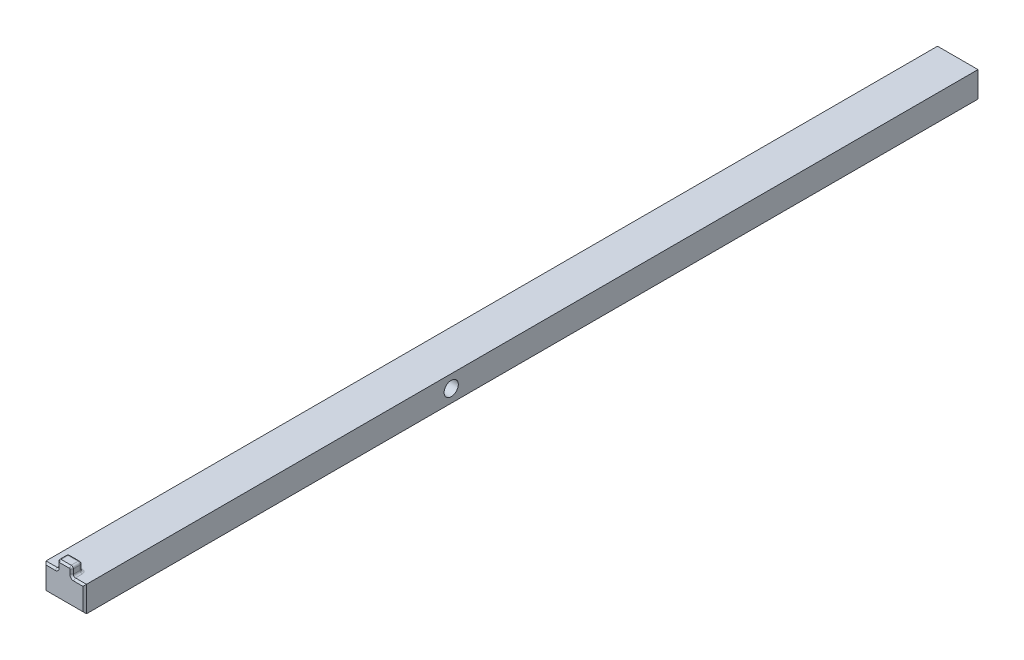
ISO-10303-21;
HEADER;
FILE_DESCRIPTION(('STEP AP214'),'2;1');
FILE_NAME('part.step','',(''),(''),'','','');
FILE_SCHEMA(('AUTOMOTIVE_DESIGN { 1 0 10303 214 1 1 1 1 }'));
ENDSEC;
DATA;
#1=APPLICATION_CONTEXT('core data for automotive mechanical design processes');
#2=APPLICATION_PROTOCOL_DEFINITION('international standard','automotive_design',2000,#1);
#3=PRODUCT_CONTEXT('',#1,'mechanical');
#4=PRODUCT('Part','Part','',(#3));
#5=PRODUCT_RELATED_PRODUCT_CATEGORY('part','',(#4));
#6=PRODUCT_DEFINITION_FORMATION('','',#4);
#7=PRODUCT_DEFINITION_CONTEXT('part definition',#1,'design');
#8=PRODUCT_DEFINITION('design','',#6,#7);
#9=PRODUCT_DEFINITION_SHAPE('','',#8);
#10=(LENGTH_UNIT() NAMED_UNIT(*) SI_UNIT(.MILLI.,.METRE.));
#11=(NAMED_UNIT(*) PLANE_ANGLE_UNIT() SI_UNIT($,.RADIAN.));
#12=(NAMED_UNIT(*) SI_UNIT($,.STERADIAN.) SOLID_ANGLE_UNIT());
#13=UNCERTAINTY_MEASURE_WITH_UNIT(LENGTH_MEASURE(1.E-05),#10,'distance_accuracy_value','');
#14=(GEOMETRIC_REPRESENTATION_CONTEXT(3) GLOBAL_UNCERTAINTY_ASSIGNED_CONTEXT((#13)) GLOBAL_UNIT_ASSIGNED_CONTEXT((#10,
#11,#12)) REPRESENTATION_CONTEXT('',''));
#15=CARTESIAN_POINT('',(0.,0.,0.));
#16=DIRECTION('',(0.,0.,1.));
#17=DIRECTION('',(1.,0.,0.));
#18=AXIS2_PLACEMENT_3D('',#15,#16,#17);
#19=CARTESIAN_POINT('',(5.7,-30.784,-36.82));
#20=DIRECTION('',(0.,-1.,0.));
#21=DIRECTION('',(0.,0.,-1.));
#22=AXIS2_PLACEMENT_3D('',#19,#20,#21);
#23=PLANE('',#22);
#24=DIRECTION('',(0.,0.,1.));
#25=VECTOR('',#24,1.);
#26=CARTESIAN_POINT('',(5.7,-30.784,-36.82));
#27=LINE('',#26,#25);
#28=CARTESIAN_POINT('',(5.7,-30.784,-288.32));
#29=VERTEX_POINT('',#28);
#30=CARTESIAN_POINT('',(5.7,-30.784,-37.32));
#31=VERTEX_POINT('',#30);
#32=EDGE_CURVE('E214',#29,#31,#27,.T.);
#33=ORIENTED_EDGE('',*,*,#32,.F.);
#34=DIRECTION('',(-1.,0.,0.));
#35=VECTOR('',#34,1.);
#36=CARTESIAN_POINT('',(5.7,-30.784,-288.32));
#37=LINE('',#36,#35);
#38=CARTESIAN_POINT('',(-5.7,-30.784,-288.32));
#39=VERTEX_POINT('',#38);
#40=EDGE_CURVE('E307',#29,#39,#37,.T.);
#41=ORIENTED_EDGE('',*,*,#40,.T.);
#42=DIRECTION('',(0.,0.,1.));
#43=VECTOR('',#42,1.);
#44=CARTESIAN_POINT('',(-5.7,-30.784,-36.82));
#45=LINE('',#44,#43);
#46=CARTESIAN_POINT('',(-5.7,-30.784,-37.32));
#47=VERTEX_POINT('',#46);
#48=EDGE_CURVE('E476',#39,#47,#45,.T.);
#49=ORIENTED_EDGE('',*,*,#48,.T.);
#50=DIRECTION('',(1.,0.,0.));
#51=VECTOR('',#50,1.);
#52=CARTESIAN_POINT('',(5.7,-30.784,-37.32));
#53=LINE('',#52,#51);
#54=CARTESIAN_POINT('',(-2.6,-30.784,-37.32));
#55=VERTEX_POINT('',#54);
#56=EDGE_CURVE('E304',#47,#55,#53,.T.);
#57=ORIENTED_EDGE('',*,*,#56,.T.);
#58=DIRECTION('',(0.,0.,1.));
#59=VECTOR('',#58,1.);
#60=CARTESIAN_POINT('',(-2.6,-30.784,-36.82));
#61=LINE('',#60,#59);
#62=CARTESIAN_POINT('',(-2.6,-30.784,-39.22));
#63=VERTEX_POINT('',#62);
#64=EDGE_CURVE('E232',#55,#63,#61,.F.);
#65=ORIENTED_EDGE('',*,*,#64,.T.);
#66=CARTESIAN_POINT('',(-1.4,-30.784,-39.22));
#67=DIRECTION('',(0.,-1.,0.));
#68=DIRECTION('',(0.,0.,-1.));
#69=AXIS2_PLACEMENT_3D('',#66,#67,#68);
#70=CIRCLE('',#69,1.2);
#71=CARTESIAN_POINT('',(-1.4,-30.784,-40.42));
#72=VERTEX_POINT('',#71);
#73=EDGE_CURVE('E229',#72,#63,#70,.F.);
#74=ORIENTED_EDGE('',*,*,#73,.F.);
#75=DIRECTION('',(1.,0.,0.));
#76=VECTOR('',#75,1.);
#77=CARTESIAN_POINT('',(2.,-30.784,-40.42));
#78=LINE('',#77,#76);
#79=CARTESIAN_POINT('',(1.4,-30.784,-40.42));
#80=VERTEX_POINT('',#79);
#81=EDGE_CURVE('E224',#72,#80,#78,.T.);
#82=ORIENTED_EDGE('',*,*,#81,.T.);
#83=CARTESIAN_POINT('',(1.4,-30.784,-39.22));
#84=DIRECTION('',(0.,-1.,0.));
#85=DIRECTION('',(0.,0.,-1.));
#86=AXIS2_PLACEMENT_3D('',#83,#84,#85);
#87=CIRCLE('',#86,1.2);
#88=CARTESIAN_POINT('',(2.6,-30.784,-39.22));
#89=VERTEX_POINT('',#88);
#90=EDGE_CURVE('E221',#89,#80,#87,.F.);
#91=ORIENTED_EDGE('',*,*,#90,.F.);
#92=DIRECTION('',(0.,0.,1.));
#93=VECTOR('',#92,1.);
#94=CARTESIAN_POINT('',(2.6,-30.784,-36.82));
#95=LINE('',#94,#93);
#96=CARTESIAN_POINT('',(2.6,-30.784,-37.32));
#97=VERTEX_POINT('',#96);
#98=EDGE_CURVE('E226',#89,#97,#95,.T.);
#99=ORIENTED_EDGE('',*,*,#98,.T.);
#100=DIRECTION('',(1.,0.,0.));
#101=VECTOR('',#100,1.);
#102=CARTESIAN_POINT('',(5.7,-30.784,-37.32));
#103=LINE('',#102,#101);
#104=EDGE_CURVE('E302',#97,#31,#103,.T.);
#105=ORIENTED_EDGE('',*,*,#104,.T.);
#106=EDGE_LOOP('',(#33,#41,#49,#57,#65,#74,#82,#91,#99,#105));
#107=FACE_BOUND('',#106,.T.);
#108=ADVANCED_FACE('F17',(#107),#23,.F.);
#109=CARTESIAN_POINT('',(5.7,0.,0.));
#110=DIRECTION('',(1.,0.,0.));
#111=DIRECTION('',(0.,0.,-1.));
#112=AXIS2_PLACEMENT_3D('',#109,#110,#111);
#113=PLANE('',#112);
#114=DIRECTION('',(0.,0.,-1.));
#115=VECTOR('',#114,1.);
#116=CARTESIAN_POINT('',(5.7,-37.984,-36.82));
#117=LINE('',#116,#115);
#118=CARTESIAN_POINT('',(5.7,-37.984,-37.32));
#119=VERTEX_POINT('',#118);
#120=CARTESIAN_POINT('',(5.7,-37.984,-288.32));
#121=VERTEX_POINT('',#120);
#122=EDGE_CURVE('E211',#119,#121,#117,.T.);
#123=ORIENTED_EDGE('',*,*,#122,.T.);
#124=DIRECTION('',(0.,1.,0.));
#125=VECTOR('',#124,1.);
#126=CARTESIAN_POINT('',(5.7,-30.784,-288.32));
#127=LINE('',#126,#125);
#128=EDGE_CURVE('E282',#121,#29,#127,.T.);
#129=ORIENTED_EDGE('',*,*,#128,.T.);
#130=ORIENTED_EDGE('',*,*,#32,.T.);
#131=DIRECTION('',(0.,-1.,0.));
#132=VECTOR('',#131,1.);
#133=CARTESIAN_POINT('',(5.7,-37.984,-37.32));
#134=LINE('',#133,#132);
#135=EDGE_CURVE('E254',#31,#119,#134,.T.);
#136=ORIENTED_EDGE('',*,*,#135,.T.);
#137=EDGE_LOOP('',(#123,#129,#130,#136));
#138=FACE_BOUND('',#137,.T.);
#139=CARTESIAN_POINT('',(5.7,-34.384,-140.));
#140=DIRECTION('',(1.,0.,0.));
#141=DIRECTION('',(0.,0.,-1.));
#142=AXIS2_PLACEMENT_3D('',#139,#140,#141);
#143=CIRCLE('',#142,2.);
#144=CARTESIAN_POINT('',(5.7,-34.384,-142.));
#145=VERTEX_POINT('',#144);
#146=EDGE_CURVE('E479',#145,#145,#143,.T.);
#147=ORIENTED_EDGE('',*,*,#146,.F.);
#148=EDGE_LOOP('',(#147));
#149=FACE_BOUND('',#148,.T.);
#150=ADVANCED_FACE('F455',(#138,#149),#113,.T.);
#151=CARTESIAN_POINT('',(-5.7,0.,0.));
#152=DIRECTION('',(1.,0.,0.));
#153=DIRECTION('',(0.,0.,-1.));
#154=AXIS2_PLACEMENT_3D('',#151,#152,#153);
#155=PLANE('',#154);
#156=ORIENTED_EDGE('',*,*,#48,.F.);
#157=DIRECTION('',(0.,-1.,0.));
#158=VECTOR('',#157,1.);
#159=CARTESIAN_POINT('',(-5.7,0.,-288.32));
#160=LINE('',#159,#158);
#161=CARTESIAN_POINT('',(-5.7,-37.984,-288.32));
#162=VERTEX_POINT('',#161);
#163=EDGE_CURVE('E300',#39,#162,#160,.T.);
#164=ORIENTED_EDGE('',*,*,#163,.T.);
#165=DIRECTION('',(0.,0.,-1.));
#166=VECTOR('',#165,1.);
#167=CARTESIAN_POINT('',(-5.7,-37.984,-36.82));
#168=LINE('',#167,#166);
#169=CARTESIAN_POINT('',(-5.7,-37.984,-37.32));
#170=VERTEX_POINT('',#169);
#171=EDGE_CURVE('E217',#170,#162,#168,.T.);
#172=ORIENTED_EDGE('',*,*,#171,.F.);
#173=DIRECTION('',(0.,1.,0.));
#174=VECTOR('',#173,1.);
#175=CARTESIAN_POINT('',(-5.7,0.,-37.32));
#176=LINE('',#175,#174);
#177=EDGE_CURVE('E298',#170,#47,#176,.T.);
#178=ORIENTED_EDGE('',*,*,#177,.T.);
#179=EDGE_LOOP('',(#156,#164,#172,#178));
#180=FACE_BOUND('',#179,.T.);
#181=CARTESIAN_POINT('',(-5.7,-34.384,-140.));
#182=DIRECTION('',(1.,0.,0.));
#183=DIRECTION('',(0.,0.,-1.));
#184=AXIS2_PLACEMENT_3D('',#181,#182,#183);
#185=CIRCLE('',#184,2.);
#186=CARTESIAN_POINT('',(-5.7,-34.384,-142.));
#187=VERTEX_POINT('',#186);
#188=EDGE_CURVE('E280',#187,#187,#185,.T.);
#189=ORIENTED_EDGE('',*,*,#188,.T.);
#190=EDGE_LOOP('',(#189));
#191=FACE_BOUND('',#190,.T.);
#192=ADVANCED_FACE('F487',(#180,#191),#155,.F.);
#193=CARTESIAN_POINT('',(5.7,-30.784,-288.82));
#194=DIRECTION('',(0.,0.,1.));
#195=DIRECTION('',(1.,0.,0.));
#196=AXIS2_PLACEMENT_3D('',#193,#194,#195);
#197=PLANE('',#196);
#198=DIRECTION('',(1.,0.,0.));
#199=VECTOR('',#198,1.);
#200=CARTESIAN_POINT('',(5.7,-31.284,-288.82));
#201=LINE('',#200,#199);
#202=CARTESIAN_POINT('',(-5.19999999999994,-31.284,-288.82));
#203=VERTEX_POINT('',#202);
#204=CARTESIAN_POINT('',(5.19999999999994,-31.284,-288.82));
#205=VERTEX_POINT('',#204);
#206=EDGE_CURVE('E285',#203,#205,#201,.T.);
#207=ORIENTED_EDGE('',*,*,#206,.T.);
#208=DIRECTION('',(0.,-1.,0.));
#209=VECTOR('',#208,1.);
#210=CARTESIAN_POINT('',(5.19999999999994,-37.984,-288.82));
#211=LINE('',#210,#209);
#212=CARTESIAN_POINT('',(5.19999999999994,-37.484,-288.82));
#213=VERTEX_POINT('',#212);
#214=EDGE_CURVE('E291',#205,#213,#211,.T.);
#215=ORIENTED_EDGE('',*,*,#214,.T.);
#216=DIRECTION('',(-1.,0.,0.));
#217=VECTOR('',#216,1.);
#218=CARTESIAN_POINT('',(5.7,-37.484,-288.82));
#219=LINE('',#218,#217);
#220=CARTESIAN_POINT('',(-5.19999999999994,-37.484,-288.82));
#221=VERTEX_POINT('',#220);
#222=EDGE_CURVE('E289',#213,#221,#219,.T.);
#223=ORIENTED_EDGE('',*,*,#222,.T.);
#224=DIRECTION('',(0.,1.,0.));
#225=VECTOR('',#224,1.);
#226=CARTESIAN_POINT('',(-5.19999999999994,-30.784,-288.82));
#227=LINE('',#226,#225);
#228=EDGE_CURVE('E287',#221,#203,#227,.T.);
#229=ORIENTED_EDGE('',*,*,#228,.T.);
#230=EDGE_LOOP('',(#207,#215,#223,#229));
#231=FACE_BOUND('',#230,.T.);
#232=ADVANCED_FACE('F509',(#231),#197,.F.);
#233=CARTESIAN_POINT('',(5.7,-30.784,-36.82));
#234=DIRECTION('',(0.,0.,-1.));
#235=DIRECTION('',(-1.,0.,0.));
#236=AXIS2_PLACEMENT_3D('',#233,#234,#235);
#237=PLANE('',#236);
#238=CARTESIAN_POINT('',(-2.6,-30.184,-36.82));
#239=DIRECTION('',(0.,0.,-1.));
#240=DIRECTION('',(-1.,0.,0.));
#241=AXIS2_PLACEMENT_3D('',#238,#239,#240);
#242=CIRCLE('',#241,1.10000000000002);
#243=CARTESIAN_POINT('',(-1.49999999999997,-30.184,-36.82));
#244=VERTEX_POINT('',#243);
#245=CARTESIAN_POINT('',(-2.6,-31.284,-36.82));
#246=VERTEX_POINT('',#245);
#247=EDGE_CURVE('E329',#244,#246,#242,.T.);
#248=ORIENTED_EDGE('',*,*,#247,.T.);
#249=DIRECTION('',(-1.,0.,0.));
#250=VECTOR('',#249,1.);
#251=CARTESIAN_POINT('',(5.7,-31.284,-36.82));
#252=LINE('',#251,#250);
#253=CARTESIAN_POINT('',(-5.2,-31.284,-36.82));
#254=VERTEX_POINT('',#253);
#255=EDGE_CURVE('E331',#246,#254,#252,.T.);
#256=ORIENTED_EDGE('',*,*,#255,.T.);
#257=DIRECTION('',(0.,-1.,0.));
#258=VECTOR('',#257,1.);
#259=CARTESIAN_POINT('',(-5.2,-30.784,-36.82));
#260=LINE('',#259,#258);
#261=CARTESIAN_POINT('',(-5.2,-37.484,-36.82));
#262=VERTEX_POINT('',#261);
#263=EDGE_CURVE('E313',#254,#262,#260,.T.);
#264=ORIENTED_EDGE('',*,*,#263,.T.);
#265=DIRECTION('',(1.,0.,0.));
#266=VECTOR('',#265,1.);
#267=CARTESIAN_POINT('',(5.7,-37.484,-36.82));
#268=LINE('',#267,#266);
#269=CARTESIAN_POINT('',(5.2,-37.484,-36.82));
#270=VERTEX_POINT('',#269);
#271=EDGE_CURVE('E311',#262,#270,#268,.T.);
#272=ORIENTED_EDGE('',*,*,#271,.T.);
#273=DIRECTION('',(0.,1.,0.));
#274=VECTOR('',#273,1.);
#275=CARTESIAN_POINT('',(5.2,-30.784,-36.82));
#276=LINE('',#275,#274);
#277=CARTESIAN_POINT('',(5.2,-31.284,-36.82));
#278=VERTEX_POINT('',#277);
#279=EDGE_CURVE('E309',#270,#278,#276,.T.);
#280=ORIENTED_EDGE('',*,*,#279,.T.);
#281=DIRECTION('',(-1.,0.,0.));
#282=VECTOR('',#281,1.);
#283=CARTESIAN_POINT('',(5.7,-31.284,-36.82));
#284=LINE('',#283,#282);
#285=CARTESIAN_POINT('',(2.6,-31.284,-36.82));
#286=VERTEX_POINT('',#285);
#287=EDGE_CURVE('E315',#278,#286,#284,.T.);
#288=ORIENTED_EDGE('',*,*,#287,.T.);
#289=CARTESIAN_POINT('',(2.6,-30.184,-36.82));
#290=DIRECTION('',(0.,0.,-1.));
#291=DIRECTION('',(-1.,0.,0.));
#292=AXIS2_PLACEMENT_3D('',#289,#290,#291);
#293=CIRCLE('',#292,1.10000000000002);
#294=CARTESIAN_POINT('',(1.49999999999997,-30.184,-36.82));
#295=VERTEX_POINT('',#294);
#296=EDGE_CURVE('E317',#286,#295,#293,.T.);
#297=ORIENTED_EDGE('',*,*,#296,.T.);
#298=DIRECTION('',(0.,1.,0.));
#299=VECTOR('',#298,1.);
#300=CARTESIAN_POINT('',(1.49999999999997,-28.884,-36.82));
#301=LINE('',#300,#299);
#302=CARTESIAN_POINT('',(1.49999999999997,-28.884,-36.82));
#303=VERTEX_POINT('',#302);
#304=EDGE_CURVE('E319',#295,#303,#301,.T.);
#305=ORIENTED_EDGE('',*,*,#304,.T.);
#306=CARTESIAN_POINT('',(1.4,-28.884,-36.82));
#307=DIRECTION('',(0.,0.,-1.));
#308=DIRECTION('',(-1.,0.,0.));
#309=AXIS2_PLACEMENT_3D('',#306,#307,#308);
#310=CIRCLE('',#309,0.0999999999999716);
#311=CARTESIAN_POINT('',(1.4,-28.784,-36.82));
#312=VERTEX_POINT('',#311);
#313=EDGE_CURVE('E321',#303,#312,#310,.F.);
#314=ORIENTED_EDGE('',*,*,#313,.T.);
#315=DIRECTION('',(-1.,0.,0.));
#316=VECTOR('',#315,1.);
#317=CARTESIAN_POINT('',(-1.4,-28.784,-36.82));
#318=LINE('',#317,#316);
#319=CARTESIAN_POINT('',(-1.4,-28.784,-36.82));
#320=VERTEX_POINT('',#319);
#321=EDGE_CURVE('E323',#312,#320,#318,.T.);
#322=ORIENTED_EDGE('',*,*,#321,.T.);
#323=CARTESIAN_POINT('',(-1.4,-28.884,-36.82));
#324=DIRECTION('',(0.,0.,-1.));
#325=DIRECTION('',(-1.,0.,0.));
#326=AXIS2_PLACEMENT_3D('',#323,#324,#325);
#327=CIRCLE('',#326,0.0999999999999716);
#328=CARTESIAN_POINT('',(-1.49999999999997,-28.884,-36.82));
#329=VERTEX_POINT('',#328);
#330=EDGE_CURVE('E325',#320,#329,#327,.F.);
#331=ORIENTED_EDGE('',*,*,#330,.T.);
#332=DIRECTION('',(0.,-1.,0.));
#333=VECTOR('',#332,1.);
#334=CARTESIAN_POINT('',(-1.49999999999997,-30.184,-36.82));
#335=LINE('',#334,#333);
#336=EDGE_CURVE('E327',#329,#244,#335,.T.);
#337=ORIENTED_EDGE('',*,*,#336,.T.);
#338=EDGE_LOOP('',(#248,#256,#264,#272,#280,#288,#297,#305,#314,#322,#331,#337));
#339=FACE_BOUND('',#338,.T.);
#340=ADVANCED_FACE('F441',(#339),#237,.F.);
#341=CARTESIAN_POINT('',(5.7,-37.984,-36.82));
#342=DIRECTION('',(0.,1.,0.));
#343=DIRECTION('',(0.,0.,1.));
#344=AXIS2_PLACEMENT_3D('',#341,#342,#343);
#345=PLANE('',#344);
#346=ORIENTED_EDGE('',*,*,#171,.T.);
#347=DIRECTION('',(1.,0.,0.));
#348=VECTOR('',#347,1.);
#349=CARTESIAN_POINT('',(5.7,-37.984,-288.32));
#350=LINE('',#349,#348);
#351=EDGE_CURVE('E296',#162,#121,#350,.T.);
#352=ORIENTED_EDGE('',*,*,#351,.T.);
#353=ORIENTED_EDGE('',*,*,#122,.F.);
#354=DIRECTION('',(-1.,0.,0.));
#355=VECTOR('',#354,1.);
#356=CARTESIAN_POINT('',(5.7,-37.984,-37.32));
#357=LINE('',#356,#355);
#358=EDGE_CURVE('E294',#119,#170,#357,.T.);
#359=ORIENTED_EDGE('',*,*,#358,.T.);
#360=EDGE_LOOP('',(#346,#352,#353,#359));
#361=FACE_BOUND('',#360,.T.);
#362=ADVANCED_FACE('F460',(#361),#345,.F.);
#363=CARTESIAN_POINT('',(5.7,-34.384,-140.));
#364=DIRECTION('',(-1.,0.,0.));
#365=DIRECTION('',(0.,0.,1.));
#366=AXIS2_PLACEMENT_3D('',#363,#364,#365);
#367=CYLINDRICAL_SURFACE('',#366,2.);
#368=ORIENTED_EDGE('',*,*,#146,.T.);
#369=EDGE_LOOP('',(#368));
#370=FACE_BOUND('',#369,.T.);
#371=ORIENTED_EDGE('',*,*,#188,.F.);
#372=EDGE_LOOP('',(#371));
#373=FACE_BOUND('',#372,.T.);
#374=ADVANCED_FACE('F489',(#370,#373),#367,.F.);
#375=CARTESIAN_POINT('',(-2.,-28.284,-39.82));
#376=DIRECTION('',(-1.,0.,0.));
#377=DIRECTION('',(0.,0.,1.));
#378=AXIS2_PLACEMENT_3D('',#375,#376,#377);
#379=PLANE('',#378);
#380=DIRECTION('',(0.,0.,1.));
#381=VECTOR('',#380,1.);
#382=CARTESIAN_POINT('',(-2.,-30.184,-39.82));
#383=LINE('',#382,#381);
#384=CARTESIAN_POINT('',(-2.,-30.184,-39.22));
#385=VERTEX_POINT('',#384);
#386=CARTESIAN_POINT('',(-2.,-30.184,-37.32));
#387=VERTEX_POINT('',#386);
#388=EDGE_CURVE('E185',#385,#387,#383,.T.);
#389=ORIENTED_EDGE('',*,*,#388,.T.);
#390=DIRECTION('',(0.,1.,0.));
#391=VECTOR('',#390,1.);
#392=CARTESIAN_POINT('',(-2.,-28.884,-37.32));
#393=LINE('',#392,#391);
#394=CARTESIAN_POINT('',(-2.,-28.884,-37.32));
#395=VERTEX_POINT('',#394);
#396=EDGE_CURVE('E182',#387,#395,#393,.T.);
#397=ORIENTED_EDGE('',*,*,#396,.T.);
#398=DIRECTION('',(0.,0.,1.));
#399=VECTOR('',#398,1.);
#400=CARTESIAN_POINT('',(-2.,-28.884,-39.82));
#401=LINE('',#400,#399);
#402=CARTESIAN_POINT('',(-2.,-28.884,-39.22));
#403=VERTEX_POINT('',#402);
#404=EDGE_CURVE('E174',#395,#403,#401,.F.);
#405=ORIENTED_EDGE('',*,*,#404,.T.);
#406=DIRECTION('',(0.,-1.,0.));
#407=VECTOR('',#406,1.);
#408=CARTESIAN_POINT('',(-2.,-30.784,-39.22));
#409=LINE('',#408,#407);
#410=EDGE_CURVE('E179',#403,#385,#409,.T.);
#411=ORIENTED_EDGE('',*,*,#410,.T.);
#412=EDGE_LOOP('',(#389,#397,#405,#411));
#413=FACE_BOUND('',#412,.T.);
#414=ADVANCED_FACE('F177',(#413),#379,.T.);
#415=CARTESIAN_POINT('',(2.,-28.284,-39.82));
#416=DIRECTION('',(0.,1.,0.));
#417=DIRECTION('',(0.,0.,1.));
#418=AXIS2_PLACEMENT_3D('',#415,#416,#417);
#419=PLANE('',#418);
#420=DIRECTION('',(0.,0.,1.));
#421=VECTOR('',#420,1.);
#422=CARTESIAN_POINT('',(-1.4,-28.284,-39.82));
#423=LINE('',#422,#421);
#424=CARTESIAN_POINT('',(-1.4,-28.284,-39.22));
#425=VERTEX_POINT('',#424);
#426=CARTESIAN_POINT('',(-1.4,-28.284,-37.32));
#427=VERTEX_POINT('',#426);
#428=EDGE_CURVE('E193',#425,#427,#423,.T.);
#429=ORIENTED_EDGE('',*,*,#428,.T.);
#430=DIRECTION('',(1.,0.,0.));
#431=VECTOR('',#430,1.);
#432=CARTESIAN_POINT('',(1.4,-28.284,-37.32));
#433=LINE('',#432,#431);
#434=CARTESIAN_POINT('',(1.4,-28.284,-37.32));
#435=VERTEX_POINT('',#434);
#436=EDGE_CURVE('E339',#427,#435,#433,.T.);
#437=ORIENTED_EDGE('',*,*,#436,.T.);
#438=DIRECTION('',(0.,0.,1.));
#439=VECTOR('',#438,1.);
#440=CARTESIAN_POINT('',(1.4,-28.284,-39.82));
#441=LINE('',#440,#439);
#442=CARTESIAN_POINT('',(1.4,-28.284,-39.22));
#443=VERTEX_POINT('',#442);
#444=EDGE_CURVE('E242',#435,#443,#441,.F.);
#445=ORIENTED_EDGE('',*,*,#444,.T.);
#446=DIRECTION('',(-1.,0.,0.));
#447=VECTOR('',#446,1.);
#448=CARTESIAN_POINT('',(-2.,-28.284,-39.22));
#449=LINE('',#448,#447);
#450=EDGE_CURVE('E240',#443,#425,#449,.T.);
#451=ORIENTED_EDGE('',*,*,#450,.T.);
#452=EDGE_LOOP('',(#429,#437,#445,#451));
#453=FACE_BOUND('',#452,.T.);
#454=ADVANCED_FACE('F429',(#453),#419,.T.);
#455=CARTESIAN_POINT('',(2.,-30.784,-39.82));
#456=DIRECTION('',(1.,0.,0.));
#457=DIRECTION('',(0.,0.,-1.));
#458=AXIS2_PLACEMENT_3D('',#455,#456,#457);
#459=PLANE('',#458);
#460=DIRECTION('',(0.,0.,1.));
#461=VECTOR('',#460,1.);
#462=CARTESIAN_POINT('',(2.,-28.884,-39.82));
#463=LINE('',#462,#461);
#464=CARTESIAN_POINT('',(2.,-28.884,-39.22));
#465=VERTEX_POINT('',#464);
#466=CARTESIAN_POINT('',(2.,-28.884,-37.32));
#467=VERTEX_POINT('',#466);
#468=EDGE_CURVE('E236',#465,#467,#463,.T.);
#469=ORIENTED_EDGE('',*,*,#468,.T.);
#470=DIRECTION('',(0.,-1.,0.));
#471=VECTOR('',#470,1.);
#472=CARTESIAN_POINT('',(2.,-30.184,-37.32));
#473=LINE('',#472,#471);
#474=CARTESIAN_POINT('',(2.,-30.184,-37.32));
#475=VERTEX_POINT('',#474);
#476=EDGE_CURVE('E27',#467,#475,#473,.T.);
#477=ORIENTED_EDGE('',*,*,#476,.T.);
#478=DIRECTION('',(0.,0.,1.));
#479=VECTOR('',#478,1.);
#480=CARTESIAN_POINT('',(2.,-30.184,-39.82));
#481=LINE('',#480,#479);
#482=CARTESIAN_POINT('',(2.,-30.184,-39.22));
#483=VERTEX_POINT('',#482);
#484=EDGE_CURVE('E238',#475,#483,#481,.F.);
#485=ORIENTED_EDGE('',*,*,#484,.T.);
#486=DIRECTION('',(0.,1.,0.));
#487=VECTOR('',#486,1.);
#488=CARTESIAN_POINT('',(2.,-28.284,-39.22));
#489=LINE('',#488,#487);
#490=EDGE_CURVE('E234',#483,#465,#489,.T.);
#491=ORIENTED_EDGE('',*,*,#490,.T.);
#492=EDGE_LOOP('',(#469,#477,#485,#491));
#493=FACE_BOUND('',#492,.T.);
#494=ADVANCED_FACE('F419',(#493),#459,.T.);
#495=CARTESIAN_POINT('',(0.,0.,-39.82));
#496=DIRECTION('',(0.,0.,1.));
#497=DIRECTION('',(1.,0.,0.));
#498=AXIS2_PLACEMENT_3D('',#495,#496,#497);
#499=PLANE('',#498);
#500=DIRECTION('',(1.,0.,0.));
#501=VECTOR('',#500,1.);
#502=CARTESIAN_POINT('',(-2.,-30.184,-39.82));
#503=LINE('',#502,#501);
#504=CARTESIAN_POINT('',(1.4,-30.184,-39.82));
#505=VERTEX_POINT('',#504);
#506=CARTESIAN_POINT('',(-1.4,-30.184,-39.82));
#507=VERTEX_POINT('',#506);
#508=EDGE_CURVE('E247',#505,#507,#503,.F.);
#509=ORIENTED_EDGE('',*,*,#508,.T.);
#510=DIRECTION('',(0.,-1.,0.));
#511=VECTOR('',#510,1.);
#512=CARTESIAN_POINT('',(-1.4,-28.284,-39.82));
#513=LINE('',#512,#511);
#514=CARTESIAN_POINT('',(-1.4,-28.884,-39.82));
#515=VERTEX_POINT('',#514);
#516=EDGE_CURVE('E252',#507,#515,#513,.F.);
#517=ORIENTED_EDGE('',*,*,#516,.T.);
#518=DIRECTION('',(-1.,0.,0.));
#519=VECTOR('',#518,1.);
#520=CARTESIAN_POINT('',(2.,-28.884,-39.82));
#521=LINE('',#520,#519);
#522=CARTESIAN_POINT('',(1.4,-28.884,-39.82));
#523=VERTEX_POINT('',#522);
#524=EDGE_CURVE('E249',#515,#523,#521,.F.);
#525=ORIENTED_EDGE('',*,*,#524,.T.);
#526=DIRECTION('',(0.,1.,0.));
#527=VECTOR('',#526,1.);
#528=CARTESIAN_POINT('',(1.4,-30.784,-39.82));
#529=LINE('',#528,#527);
#530=EDGE_CURVE('E245',#523,#505,#529,.F.);
#531=ORIENTED_EDGE('',*,*,#530,.T.);
#532=EDGE_LOOP('',(#509,#517,#525,#531));
#533=FACE_BOUND('',#532,.T.);
#534=ADVANCED_FACE('F412',(#533),#499,.F.);
#535=CARTESIAN_POINT('',(1.4,-28.884,-39.82));
#536=DIRECTION('',(0.,0.,1.));
#537=DIRECTION('',(1.,0.,0.));
#538=AXIS2_PLACEMENT_3D('',#535,#536,#537);
#539=CYLINDRICAL_SURFACE('',#538,0.6);
#540=ORIENTED_EDGE('',*,*,#444,.F.);
#541=CARTESIAN_POINT('',(1.4,-28.884,-37.32));
#542=DIRECTION('',(0.,0.,-1.));
#543=DIRECTION('',(-1.,0.,0.));
#544=AXIS2_PLACEMENT_3D('',#541,#542,#543);
#545=CIRCLE('',#544,0.6);
#546=EDGE_CURVE('E42',#435,#467,#545,.T.);
#547=ORIENTED_EDGE('',*,*,#546,.T.);
#548=ORIENTED_EDGE('',*,*,#468,.F.);
#549=CARTESIAN_POINT('',(1.4,-28.884,-39.22));
#550=DIRECTION('',(0.,0.,-1.));
#551=DIRECTION('',(-1.,0.,0.));
#552=AXIS2_PLACEMENT_3D('',#549,#550,#551);
#553=CIRCLE('',#552,0.6);
#554=EDGE_CURVE('E277',#443,#465,#553,.T.);
#555=ORIENTED_EDGE('',*,*,#554,.F.);
#556=EDGE_LOOP('',(#540,#547,#548,#555));
#557=FACE_BOUND('',#556,.T.);
#558=ADVANCED_FACE('F421',(#557),#539,.T.);
#559=CARTESIAN_POINT('',(1.4,-28.884,-39.22));
#560=DIRECTION('',(1.,0.,0.));
#561=DIRECTION('',(0.,0.,-1.));
#562=AXIS2_PLACEMENT_3D('',#559,#560,#561);
#563=SPHERICAL_SURFACE('',#562,0.6);
#564=CARTESIAN_POINT('',(1.4,-28.884,-39.22));
#565=DIRECTION('',(1.,0.,0.));
#566=DIRECTION('',(0.,0.,-1.));
#567=AXIS2_PLACEMENT_3D('',#564,#565,#566);
#568=CIRCLE('',#567,0.6);
#569=EDGE_CURVE('E271',#443,#523,#568,.F.);
#570=ORIENTED_EDGE('',*,*,#569,.F.);
#571=ORIENTED_EDGE('',*,*,#554,.T.);
#572=CARTESIAN_POINT('',(1.4,-28.884,-39.22));
#573=DIRECTION('',(0.,1.,0.));
#574=DIRECTION('',(0.,0.,1.));
#575=AXIS2_PLACEMENT_3D('',#572,#573,#574);
#576=CIRCLE('',#575,0.6);
#577=EDGE_CURVE('E274',#523,#465,#576,.F.);
#578=ORIENTED_EDGE('',*,*,#577,.F.);
#579=EDGE_LOOP('',(#570,#571,#578));
#580=FACE_BOUND('',#579,.T.);
#581=ADVANCED_FACE('F424',(#580),#563,.T.);
#582=CARTESIAN_POINT('',(2.6,-30.184,-36.82));
#583=DIRECTION('',(0.,0.,1.));
#584=DIRECTION('',(0.,-1.,0.));
#585=AXIS2_PLACEMENT_3D('',#582,#583,#584);
#586=CYLINDRICAL_SURFACE('',#585,0.6);
#587=ORIENTED_EDGE('',*,*,#484,.F.);
#588=CARTESIAN_POINT('',(2.6,-30.184,-37.32));
#589=DIRECTION('',(0.,0.,-1.));
#590=DIRECTION('',(-1.,0.,0.));
#591=AXIS2_PLACEMENT_3D('',#588,#589,#590);
#592=CIRCLE('',#591,0.6);
#593=EDGE_CURVE('E11',#475,#97,#592,.F.);
#594=ORIENTED_EDGE('',*,*,#593,.T.);
#595=ORIENTED_EDGE('',*,*,#98,.F.);
#596=CARTESIAN_POINT('',(2.6,-30.184,-39.22));
#597=DIRECTION('',(0.,0.,1.));
#598=DIRECTION('',(1.,0.,0.));
#599=AXIS2_PLACEMENT_3D('',#596,#597,#598);
#600=CIRCLE('',#599,0.6);
#601=EDGE_CURVE('E268',#483,#89,#600,.T.);
#602=ORIENTED_EDGE('',*,*,#601,.F.);
#603=EDGE_LOOP('',(#587,#594,#595,#602));
#604=FACE_BOUND('',#603,.T.);
#605=ADVANCED_FACE('F398',(#604),#586,.F.);
#606=CARTESIAN_POINT('',(1.4,-30.784,-39.22));
#607=DIRECTION('',(0.,-1.,0.));
#608=DIRECTION('',(0.,0.,-1.));
#609=AXIS2_PLACEMENT_3D('',#606,#607,#608);
#610=CYLINDRICAL_SURFACE('',#609,0.6);
#611=ORIENTED_EDGE('',*,*,#577,.T.);
#612=ORIENTED_EDGE('',*,*,#490,.F.);
#613=CARTESIAN_POINT('',(1.4,-30.184,-39.22));
#614=DIRECTION('',(0.,-1.,0.));
#615=DIRECTION('',(0.,0.,-1.));
#616=AXIS2_PLACEMENT_3D('',#613,#614,#615);
#617=CIRCLE('',#616,0.6);
#618=EDGE_CURVE('E265',#505,#483,#617,.T.);
#619=ORIENTED_EDGE('',*,*,#618,.F.);
#620=ORIENTED_EDGE('',*,*,#530,.F.);
#621=EDGE_LOOP('',(#611,#612,#619,#620));
#622=FACE_BOUND('',#621,.T.);
#623=ADVANCED_FACE('F418',(#622),#610,.T.);
#624=CARTESIAN_POINT('',(2.,-28.884,-39.22));
#625=DIRECTION('',(1.,0.,0.));
#626=DIRECTION('',(0.,0.,-1.));
#627=AXIS2_PLACEMENT_3D('',#624,#625,#626);
#628=CYLINDRICAL_SURFACE('',#627,0.6);
#629=ORIENTED_EDGE('',*,*,#569,.T.);
#630=ORIENTED_EDGE('',*,*,#524,.F.);
#631=CARTESIAN_POINT('',(-1.4,-28.884,-39.22));
#632=DIRECTION('',(-1.,0.,0.));
#633=DIRECTION('',(0.,0.,1.));
#634=AXIS2_PLACEMENT_3D('',#631,#632,#633);
#635=CIRCLE('',#634,0.6);
#636=EDGE_CURVE('E197',#425,#515,#635,.T.);
#637=ORIENTED_EDGE('',*,*,#636,.F.);
#638=ORIENTED_EDGE('',*,*,#450,.F.);
#639=EDGE_LOOP('',(#629,#630,#637,#638));
#640=FACE_BOUND('',#639,.T.);
#641=ADVANCED_FACE('F427',(#640),#628,.T.);
#642=CARTESIAN_POINT('',(-1.4,-28.884,-39.82));
#643=DIRECTION('',(0.,0.,1.));
#644=DIRECTION('',(1.,0.,0.));
#645=AXIS2_PLACEMENT_3D('',#642,#643,#644);
#646=CYLINDRICAL_SURFACE('',#645,0.6);
#647=ORIENTED_EDGE('',*,*,#404,.F.);
#648=CARTESIAN_POINT('',(-1.4,-28.884,-37.32));
#649=DIRECTION('',(0.,0.,-1.));
#650=DIRECTION('',(-1.,0.,0.));
#651=AXIS2_PLACEMENT_3D('',#648,#649,#650);
#652=CIRCLE('',#651,0.6);
#653=EDGE_CURVE('E337',#395,#427,#652,.T.);
#654=ORIENTED_EDGE('',*,*,#653,.T.);
#655=ORIENTED_EDGE('',*,*,#428,.F.);
#656=CARTESIAN_POINT('',(-1.4,-28.884,-39.22));
#657=DIRECTION('',(0.,0.,-1.));
#658=DIRECTION('',(-1.,0.,0.));
#659=AXIS2_PLACEMENT_3D('',#656,#657,#658);
#660=CIRCLE('',#659,0.6);
#661=EDGE_CURVE('E189',#403,#425,#660,.T.);
#662=ORIENTED_EDGE('',*,*,#661,.F.);
#663=EDGE_LOOP('',(#647,#654,#655,#662));
#664=FACE_BOUND('',#663,.T.);
#665=ADVANCED_FACE('F191',(#664),#646,.T.);
#666=CARTESIAN_POINT('',(1.4,-30.184,-39.22));
#667=DIRECTION('',(0.,-1.,0.));
#668=DIRECTION('',(0.,0.,-1.));
#669=AXIS2_PLACEMENT_3D('',#666,#667,#668);
#670=TOROIDAL_SURFACE('',#669,1.2,0.6);
#671=ORIENTED_EDGE('',*,*,#601,.T.);
#672=ORIENTED_EDGE('',*,*,#90,.T.);
#673=CARTESIAN_POINT('',(1.4,-30.184,-40.42));
#674=DIRECTION('',(-1.,0.,0.));
#675=DIRECTION('',(0.,0.,1.));
#676=AXIS2_PLACEMENT_3D('',#673,#674,#675);
#677=CIRCLE('',#676,0.6);
#678=EDGE_CURVE('E198',#505,#80,#677,.F.);
#679=ORIENTED_EDGE('',*,*,#678,.F.);
#680=ORIENTED_EDGE('',*,*,#618,.T.);
#681=EDGE_LOOP('',(#671,#672,#679,#680));
#682=FACE_BOUND('',#681,.T.);
#683=ADVANCED_FACE('F406',(#682),#670,.F.);
#684=CARTESIAN_POINT('',(-1.4,-28.884,-39.22));
#685=DIRECTION('',(0.,1.,0.));
#686=DIRECTION('',(0.,0.,1.));
#687=AXIS2_PLACEMENT_3D('',#684,#685,#686);
#688=SPHERICAL_SURFACE('',#687,0.6);
#689=ORIENTED_EDGE('',*,*,#661,.T.);
#690=ORIENTED_EDGE('',*,*,#636,.T.);
#691=CARTESIAN_POINT('',(-1.4,-28.884,-39.22));
#692=DIRECTION('',(0.,1.,0.));
#693=DIRECTION('',(0.,0.,1.));
#694=AXIS2_PLACEMENT_3D('',#691,#692,#693);
#695=CIRCLE('',#694,0.6);
#696=EDGE_CURVE('E201',#403,#515,#695,.F.);
#697=ORIENTED_EDGE('',*,*,#696,.F.);
#698=EDGE_LOOP('',(#689,#690,#697));
#699=FACE_BOUND('',#698,.T.);
#700=ADVANCED_FACE('F202',(#699),#688,.T.);
#701=CARTESIAN_POINT('',(5.7,-30.184,-40.42));
#702=DIRECTION('',(-1.,0.,0.));
#703=DIRECTION('',(0.,0.,1.));
#704=AXIS2_PLACEMENT_3D('',#701,#702,#703);
#705=CYLINDRICAL_SURFACE('',#704,0.6);
#706=ORIENTED_EDGE('',*,*,#678,.T.);
#707=ORIENTED_EDGE('',*,*,#81,.F.);
#708=CARTESIAN_POINT('',(-1.4,-30.184,-40.42));
#709=DIRECTION('',(1.,0.,0.));
#710=DIRECTION('',(0.,0.,-1.));
#711=AXIS2_PLACEMENT_3D('',#708,#709,#710);
#712=CIRCLE('',#711,0.6);
#713=EDGE_CURVE('E205',#507,#72,#712,.T.);
#714=ORIENTED_EDGE('',*,*,#713,.F.);
#715=ORIENTED_EDGE('',*,*,#508,.F.);
#716=EDGE_LOOP('',(#706,#707,#714,#715));
#717=FACE_BOUND('',#716,.T.);
#718=ADVANCED_FACE('F409',(#717),#705,.F.);
#719=CARTESIAN_POINT('',(-1.4,-28.284,-39.22));
#720=DIRECTION('',(0.,1.,0.));
#721=DIRECTION('',(0.,0.,1.));
#722=AXIS2_PLACEMENT_3D('',#719,#720,#721);
#723=CYLINDRICAL_SURFACE('',#722,0.6);
#724=ORIENTED_EDGE('',*,*,#696,.T.);
#725=ORIENTED_EDGE('',*,*,#516,.F.);
#726=CARTESIAN_POINT('',(-1.4,-30.184,-39.22));
#727=DIRECTION('',(0.,-1.,0.));
#728=DIRECTION('',(0.,0.,-1.));
#729=AXIS2_PLACEMENT_3D('',#726,#727,#728);
#730=CIRCLE('',#729,0.6);
#731=EDGE_CURVE('E209',#385,#507,#730,.T.);
#732=ORIENTED_EDGE('',*,*,#731,.F.);
#733=ORIENTED_EDGE('',*,*,#410,.F.);
#734=EDGE_LOOP('',(#724,#725,#732,#733));
#735=FACE_BOUND('',#734,.T.);
#736=ADVANCED_FACE('F207',(#735),#723,.T.);
#737=CARTESIAN_POINT('',(-1.4,-30.184,-39.22));
#738=DIRECTION('',(0.,-1.,0.));
#739=DIRECTION('',(0.,0.,-1.));
#740=AXIS2_PLACEMENT_3D('',#737,#738,#739);
#741=TOROIDAL_SURFACE('',#740,1.2,0.6);
#742=ORIENTED_EDGE('',*,*,#713,.T.);
#743=ORIENTED_EDGE('',*,*,#73,.T.);
#744=CARTESIAN_POINT('',(-2.6,-30.184,-39.22));
#745=DIRECTION('',(0.,0.,1.));
#746=DIRECTION('',(1.,0.,0.));
#747=AXIS2_PLACEMENT_3D('',#744,#745,#746);
#748=CIRCLE('',#747,0.6);
#749=EDGE_CURVE('E255',#385,#63,#748,.F.);
#750=ORIENTED_EDGE('',*,*,#749,.F.);
#751=ORIENTED_EDGE('',*,*,#731,.T.);
#752=EDGE_LOOP('',(#742,#743,#750,#751));
#753=FACE_BOUND('',#752,.T.);
#754=ADVANCED_FACE('F517',(#753),#741,.F.);
#755=CARTESIAN_POINT('',(-2.6,-30.184,-39.82));
#756=DIRECTION('',(0.,0.,1.));
#757=DIRECTION('',(0.,-1.,0.));
#758=AXIS2_PLACEMENT_3D('',#755,#756,#757);
#759=CYLINDRICAL_SURFACE('',#758,0.6);
#760=ORIENTED_EDGE('',*,*,#64,.F.);
#761=CARTESIAN_POINT('',(-2.6,-30.184,-37.32));
#762=DIRECTION('',(0.,0.,-1.));
#763=DIRECTION('',(-1.,0.,0.));
#764=AXIS2_PLACEMENT_3D('',#761,#762,#763);
#765=CIRCLE('',#764,0.6);
#766=EDGE_CURVE('E334',#55,#387,#765,.F.);
#767=ORIENTED_EDGE('',*,*,#766,.T.);
#768=ORIENTED_EDGE('',*,*,#388,.F.);
#769=ORIENTED_EDGE('',*,*,#749,.T.);
#770=EDGE_LOOP('',(#760,#767,#768,#769));
#771=FACE_BOUND('',#770,.T.);
#772=ADVANCED_FACE('F513',(#771),#759,.F.);
#773=CARTESIAN_POINT('',(-5.19999999999994,-30.784,-288.82));
#774=DIRECTION('',(0.707106781186548,0.,0.707106781186548));
#775=DIRECTION('',(0.,1.,0.));
#776=AXIS2_PLACEMENT_3D('',#773,#774,#775);
#777=PLANE('',#776);
#778=DIRECTION('',(-0.577350269189626,0.577350269189626,0.577350269189626));
#779=VECTOR('',#778,1.);
#780=CARTESIAN_POINT('',(-1.9,-34.584,-292.12));
#781=LINE('',#780,#779);
#782=EDGE_CURVE('E347',#203,#39,#781,.T.);
#783=ORIENTED_EDGE('',*,*,#782,.F.);
#784=ORIENTED_EDGE('',*,*,#228,.F.);
#785=DIRECTION('',(-0.577350269189626,-0.577350269189626,0.577350269189626));
#786=VECTOR('',#785,1.);
#787=CARTESIAN_POINT('',(-2.96666666666663,-35.2506666666667,-291.053333333334));
#788=LINE('',#787,#786);
#789=EDGE_CURVE('E258',#162,#221,#788,.F.);
#790=ORIENTED_EDGE('',*,*,#789,.F.);
#791=ORIENTED_EDGE('',*,*,#163,.F.);
#792=EDGE_LOOP('',(#783,#784,#790,#791));
#793=FACE_BOUND('',#792,.T.);
#794=ADVANCED_FACE('F516',(#793),#777,.F.);
#795=CARTESIAN_POINT('',(5.7,-37.484,-288.82));
#796=DIRECTION('',(0.,0.707106781186548,0.707106781186548));
#797=DIRECTION('',(-1.,0.,0.));
#798=AXIS2_PLACEMENT_3D('',#795,#796,#797);
#799=PLANE('',#798);
#800=ORIENTED_EDGE('',*,*,#789,.T.);
#801=ORIENTED_EDGE('',*,*,#222,.F.);
#802=DIRECTION('',(-0.577350269189626,0.577350269189626,-0.577350269189626));
#803=VECTOR('',#802,1.);
#804=CARTESIAN_POINT('',(5.36666666666663,-37.6506666666667,-288.653333333334));
#805=LINE('',#804,#803);
#806=EDGE_CURVE('E345',#121,#213,#805,.T.);
#807=ORIENTED_EDGE('',*,*,#806,.F.);
#808=ORIENTED_EDGE('',*,*,#351,.F.);
#809=EDGE_LOOP('',(#800,#801,#807,#808));
#810=FACE_BOUND('',#809,.T.);
#811=ADVANCED_FACE('F465',(#810),#799,.F.);
#812=CARTESIAN_POINT('',(5.7,-30.784,-288.32));
#813=DIRECTION('',(0.,-0.707106781186548,0.707106781186548));
#814=DIRECTION('',(-1.,0.,0.));
#815=AXIS2_PLACEMENT_3D('',#812,#813,#814);
#816=PLANE('',#815);
#817=ORIENTED_EDGE('',*,*,#782,.T.);
#818=ORIENTED_EDGE('',*,*,#40,.F.);
#819=DIRECTION('',(0.577350269189626,0.577350269189626,0.577350269189626));
#820=VECTOR('',#819,1.);
#821=CARTESIAN_POINT('',(5.7,-30.784,-288.32));
#822=LINE('',#821,#820);
#823=EDGE_CURVE('E343',#205,#29,#822,.T.);
#824=ORIENTED_EDGE('',*,*,#823,.F.);
#825=ORIENTED_EDGE('',*,*,#206,.F.);
#826=EDGE_LOOP('',(#817,#818,#824,#825));
#827=FACE_BOUND('',#826,.T.);
#828=ADVANCED_FACE('F549',(#827),#816,.F.);
#829=CARTESIAN_POINT('',(5.7,0.,-288.32));
#830=DIRECTION('',(0.707106781186548,0.,-0.707106781186548));
#831=DIRECTION('',(0.,-1.,0.));
#832=AXIS2_PLACEMENT_3D('',#829,#830,#831);
#833=PLANE('',#832);
#834=ORIENTED_EDGE('',*,*,#806,.T.);
#835=ORIENTED_EDGE('',*,*,#214,.F.);
#836=ORIENTED_EDGE('',*,*,#823,.T.);
#837=ORIENTED_EDGE('',*,*,#128,.F.);
#838=EDGE_LOOP('',(#834,#835,#836,#837));
#839=FACE_BOUND('',#838,.T.);
#840=ADVANCED_FACE('F470',(#839),#833,.T.);
#841=CARTESIAN_POINT('',(1.49999999999997,-30.784,-36.82));
#842=DIRECTION('',(0.707106781186548,0.,0.707106781186548));
#843=DIRECTION('',(0.,-1.,0.));
#844=AXIS2_PLACEMENT_3D('',#841,#842,#843);
#845=PLANE('',#844);
#846=DIRECTION('',(-0.707106781186548,0.,0.707106781186548));
#847=VECTOR('',#846,1.);
#848=CARTESIAN_POINT('',(2.,-30.184,-37.32));
#849=LINE('',#848,#847);
#850=EDGE_CURVE('E379',#475,#295,#849,.T.);
#851=ORIENTED_EDGE('',*,*,#850,.F.);
#852=ORIENTED_EDGE('',*,*,#476,.F.);
#853=DIRECTION('',(0.707106781186548,0.,-0.707106781186548));
#854=VECTOR('',#853,1.);
#855=CARTESIAN_POINT('',(1.49999999999997,-28.884,-36.82));
#856=LINE('',#855,#854);
#857=EDGE_CURVE('E22',#303,#467,#856,.T.);
#858=ORIENTED_EDGE('',*,*,#857,.F.);
#859=ORIENTED_EDGE('',*,*,#304,.F.);
#860=EDGE_LOOP('',(#851,#852,#858,#859));
#861=FACE_BOUND('',#860,.T.);
#862=ADVANCED_FACE('F20',(#861),#845,.T.);
#863=CARTESIAN_POINT('',(1.4,-28.884,-36.82));
#864=DIRECTION('',(0.,0.,-1.));
#865=DIRECTION('',(-1.,0.,0.));
#866=AXIS2_PLACEMENT_3D('',#863,#864,#865);
#867=CONICAL_SURFACE('',#866,0.0999999999999716,0.785398163397448);
#868=ORIENTED_EDGE('',*,*,#857,.T.);
#869=ORIENTED_EDGE('',*,*,#546,.F.);
#870=DIRECTION('',(0.,0.707106781186548,-0.707106781186548));
#871=VECTOR('',#870,1.);
#872=CARTESIAN_POINT('',(1.4,-28.784,-36.82));
#873=LINE('',#872,#871);
#874=EDGE_CURVE('E377',#312,#435,#873,.T.);
#875=ORIENTED_EDGE('',*,*,#874,.F.);
#876=ORIENTED_EDGE('',*,*,#313,.F.);
#877=EDGE_LOOP('',(#868,#869,#875,#876));
#878=FACE_BOUND('',#877,.T.);
#879=ADVANCED_FACE('F389',(#878),#867,.T.);
#880=CARTESIAN_POINT('',(2.6,-30.184,-36.82));
#881=DIRECTION('',(0.,0.,1.));
#882=DIRECTION('',(1.,0.,0.));
#883=AXIS2_PLACEMENT_3D('',#880,#881,#882);
#884=CONICAL_SURFACE('',#883,1.10000000000002,0.785398163397445);
#885=ORIENTED_EDGE('',*,*,#850,.T.);
#886=ORIENTED_EDGE('',*,*,#296,.F.);
#887=DIRECTION('',(0.,-0.707106781186545,0.70710678118655));
#888=VECTOR('',#887,1.);
#889=CARTESIAN_POINT('',(2.6,-30.784,-37.32));
#890=LINE('',#889,#888);
#891=EDGE_CURVE('E374',#97,#286,#890,.T.);
#892=ORIENTED_EDGE('',*,*,#891,.F.);
#893=ORIENTED_EDGE('',*,*,#593,.F.);
#894=EDGE_LOOP('',(#885,#886,#892,#893));
#895=FACE_BOUND('',#894,.T.);
#896=ADVANCED_FACE('F394',(#895),#884,.F.);
#897=CARTESIAN_POINT('',(5.7,-28.784,-36.82));
#898=DIRECTION('',(0.,0.707106781186548,0.707106781186548));
#899=DIRECTION('',(1.,0.,0.));
#900=AXIS2_PLACEMENT_3D('',#897,#898,#899);
#901=PLANE('',#900);
#902=ORIENTED_EDGE('',*,*,#874,.T.);
#903=ORIENTED_EDGE('',*,*,#436,.F.);
#904=DIRECTION('',(0.,0.707106781186548,-0.707106781186548));
#905=VECTOR('',#904,1.);
#906=CARTESIAN_POINT('',(-1.4,-28.784,-36.82));
#907=LINE('',#906,#905);
#908=EDGE_CURVE('E371',#320,#427,#907,.T.);
#909=ORIENTED_EDGE('',*,*,#908,.F.);
#910=ORIENTED_EDGE('',*,*,#321,.F.);
#911=EDGE_LOOP('',(#902,#903,#909,#910));
#912=FACE_BOUND('',#911,.T.);
#913=ADVANCED_FACE('F433',(#912),#901,.T.);
#914=CARTESIAN_POINT('',(5.7,-31.284,-36.82));
#915=DIRECTION('',(0.,-0.70710678118655,-0.707106781186545));
#916=DIRECTION('',(-1.,0.,0.));
#917=AXIS2_PLACEMENT_3D('',#914,#915,#916);
#918=PLANE('',#917);
#919=ORIENTED_EDGE('',*,*,#891,.T.);
#920=ORIENTED_EDGE('',*,*,#287,.F.);
#921=DIRECTION('',(0.577350269189627,0.577350269189623,-0.577350269189627));
#922=VECTOR('',#921,1.);
#923=CARTESIAN_POINT('',(15.9613333333333,-20.5226666666668,-47.5813333333334));
#924=LINE('',#923,#922);
#925=EDGE_CURVE('E368',#31,#278,#924,.F.);
#926=ORIENTED_EDGE('',*,*,#925,.F.);
#927=ORIENTED_EDGE('',*,*,#104,.F.);
#928=EDGE_LOOP('',(#919,#920,#926,#927));
#929=FACE_BOUND('',#928,.T.);
#930=ADVANCED_FACE('F445',(#929),#918,.F.);
#931=CARTESIAN_POINT('',(-1.4,-28.884,-36.82));
#932=DIRECTION('',(0.,0.,-1.));
#933=DIRECTION('',(-1.,0.,0.));
#934=AXIS2_PLACEMENT_3D('',#931,#932,#933);
#935=CONICAL_SURFACE('',#934,0.0999999999999716,0.785398163397448);
#936=ORIENTED_EDGE('',*,*,#908,.T.);
#937=ORIENTED_EDGE('',*,*,#653,.F.);
#938=DIRECTION('',(-0.707106781186548,0.,-0.707106781186548));
#939=VECTOR('',#938,1.);
#940=CARTESIAN_POINT('',(-1.49999999999997,-28.884,-36.82));
#941=LINE('',#940,#939);
#942=EDGE_CURVE('E365',#329,#395,#941,.T.);
#943=ORIENTED_EDGE('',*,*,#942,.F.);
#944=ORIENTED_EDGE('',*,*,#330,.F.);
#945=EDGE_LOOP('',(#936,#937,#943,#944));
#946=FACE_BOUND('',#945,.T.);
#947=ADVANCED_FACE('F437',(#946),#935,.T.);
#948=CARTESIAN_POINT('',(5.7,0.,-37.32));
#949=DIRECTION('',(0.707106781186548,0.,0.707106781186548));
#950=DIRECTION('',(0.,1.,0.));
#951=AXIS2_PLACEMENT_3D('',#948,#949,#950);
#952=PLANE('',#951);
#953=ORIENTED_EDGE('',*,*,#925,.T.);
#954=ORIENTED_EDGE('',*,*,#279,.F.);
#955=DIRECTION('',(-0.577350269189626,0.577350269189626,0.577350269189626));
#956=VECTOR('',#955,1.);
#957=CARTESIAN_POINT('',(-6.96133333333333,-25.3226666666667,-24.6586666666668));
#958=LINE('',#957,#956);
#959=EDGE_CURVE('E362',#119,#270,#958,.T.);
#960=ORIENTED_EDGE('',*,*,#959,.F.);
#961=ORIENTED_EDGE('',*,*,#135,.F.);
#962=EDGE_LOOP('',(#953,#954,#960,#961));
#963=FACE_BOUND('',#962,.T.);
#964=ADVANCED_FACE('F451',(#963),#952,.T.);
#965=CARTESIAN_POINT('',(-1.49999999999997,-30.784,-36.82));
#966=DIRECTION('',(-0.707106781186548,0.,0.707106781186548));
#967=DIRECTION('',(0.,1.,0.));
#968=AXIS2_PLACEMENT_3D('',#965,#966,#967);
#969=PLANE('',#968);
#970=ORIENTED_EDGE('',*,*,#942,.T.);
#971=ORIENTED_EDGE('',*,*,#396,.F.);
#972=DIRECTION('',(-0.707106781186548,0.,-0.707106781186548));
#973=VECTOR('',#972,1.);
#974=CARTESIAN_POINT('',(-1.49999999999997,-30.184,-36.82));
#975=LINE('',#974,#973);
#976=EDGE_CURVE('E359',#244,#387,#975,.T.);
#977=ORIENTED_EDGE('',*,*,#976,.F.);
#978=ORIENTED_EDGE('',*,*,#336,.F.);
#979=EDGE_LOOP('',(#970,#971,#977,#978));
#980=FACE_BOUND('',#979,.T.);
#981=ADVANCED_FACE('F594',(#980),#969,.T.);
#982=CARTESIAN_POINT('',(5.7,-37.984,-37.32));
#983=DIRECTION('',(0.,0.707106781186548,-0.707106781186548));
#984=DIRECTION('',(-1.,0.,0.));
#985=AXIS2_PLACEMENT_3D('',#982,#983,#984);
#986=PLANE('',#985);
#987=ORIENTED_EDGE('',*,*,#959,.T.);
#988=ORIENTED_EDGE('',*,*,#271,.F.);
#989=DIRECTION('',(-0.577350269189626,-0.577350269189626,-0.577350269189626));
#990=VECTOR('',#989,1.);
#991=CARTESIAN_POINT('',(-1.9,-34.184,-33.52));
#992=LINE('',#991,#990);
#993=EDGE_CURVE('E356',#170,#262,#992,.F.);
#994=ORIENTED_EDGE('',*,*,#993,.F.);
#995=ORIENTED_EDGE('',*,*,#358,.F.);
#996=EDGE_LOOP('',(#987,#988,#994,#995));
#997=FACE_BOUND('',#996,.T.);
#998=ADVANCED_FACE('F587',(#997),#986,.F.);
#999=CARTESIAN_POINT('',(-2.6,-30.184,-36.82));
#1000=DIRECTION('',(0.,0.,1.));
#1001=DIRECTION('',(1.,0.,0.));
#1002=AXIS2_PLACEMENT_3D('',#999,#1000,#1001);
#1003=CONICAL_SURFACE('',#1002,1.10000000000003,0.785398163397448);
#1004=ORIENTED_EDGE('',*,*,#976,.T.);
#1005=ORIENTED_EDGE('',*,*,#766,.F.);
#1006=DIRECTION('',(0.,0.707106781186545,-0.70710678118655));
#1007=VECTOR('',#1006,1.);
#1008=CARTESIAN_POINT('',(-2.6,-31.284,-36.82));
#1009=LINE('',#1008,#1007);
#1010=EDGE_CURVE('E354',#246,#55,#1009,.T.);
#1011=ORIENTED_EDGE('',*,*,#1010,.F.);
#1012=ORIENTED_EDGE('',*,*,#247,.F.);
#1013=EDGE_LOOP('',(#1004,#1005,#1011,#1012));
#1014=FACE_BOUND('',#1013,.T.);
#1015=ADVANCED_FACE('F580',(#1014),#1003,.F.);
#1016=CARTESIAN_POINT('',(-5.2,-30.784,-36.82));
#1017=DIRECTION('',(0.707106781186548,0.,-0.707106781186548));
#1018=DIRECTION('',(0.,-1.,0.));
#1019=AXIS2_PLACEMENT_3D('',#1016,#1017,#1018);
#1020=PLANE('',#1019);
#1021=ORIENTED_EDGE('',*,*,#993,.T.);
#1022=ORIENTED_EDGE('',*,*,#263,.F.);
#1023=DIRECTION('',(-0.577350269189627,0.577350269189623,-0.577350269189627));
#1024=VECTOR('',#1023,1.);
#1025=CARTESIAN_POINT('',(-5.36666666666665,-31.1173333333334,-36.9866666666667));
#1026=LINE('',#1025,#1024);
#1027=EDGE_CURVE('E352',#47,#254,#1026,.F.);
#1028=ORIENTED_EDGE('',*,*,#1027,.F.);
#1029=ORIENTED_EDGE('',*,*,#177,.F.);
#1030=EDGE_LOOP('',(#1021,#1022,#1028,#1029));
#1031=FACE_BOUND('',#1030,.T.);
#1032=ADVANCED_FACE('F573',(#1031),#1020,.F.);
#1033=CARTESIAN_POINT('',(5.7,-31.284,-36.82));
#1034=DIRECTION('',(0.,-0.70710678118655,-0.707106781186545));
#1035=DIRECTION('',(-1.,0.,0.));
#1036=AXIS2_PLACEMENT_3D('',#1033,#1034,#1035);
#1037=PLANE('',#1036);
#1038=ORIENTED_EDGE('',*,*,#1010,.T.);
#1039=ORIENTED_EDGE('',*,*,#56,.F.);
#1040=ORIENTED_EDGE('',*,*,#1027,.T.);
#1041=ORIENTED_EDGE('',*,*,#255,.F.);
#1042=EDGE_LOOP('',(#1038,#1039,#1040,#1041));
#1043=FACE_BOUND('',#1042,.T.);
#1044=ADVANCED_FACE('F567',(#1043),#1037,.F.);
#1045=CLOSED_SHELL('',(#108,#150,#192,#232,#340,#362,#374,#414,#454,#494,#534,#558,#581,#605,
#623,#641,#665,#683,#700,#718,#736,#754,#772,#794,#811,#828,#840,#862,#879,#896,#913,#930,#947,
#964,#981,#998,#1015,#1032,#1044));
#1046=MANIFOLD_SOLID_BREP('B1',#1045);
#1047=ADVANCED_BREP_SHAPE_REPRESENTATION('',(#18,#1046),#14);
#1048=SHAPE_DEFINITION_REPRESENTATION(#9,#1047);
ENDSEC;
END-ISO-10303-21;
